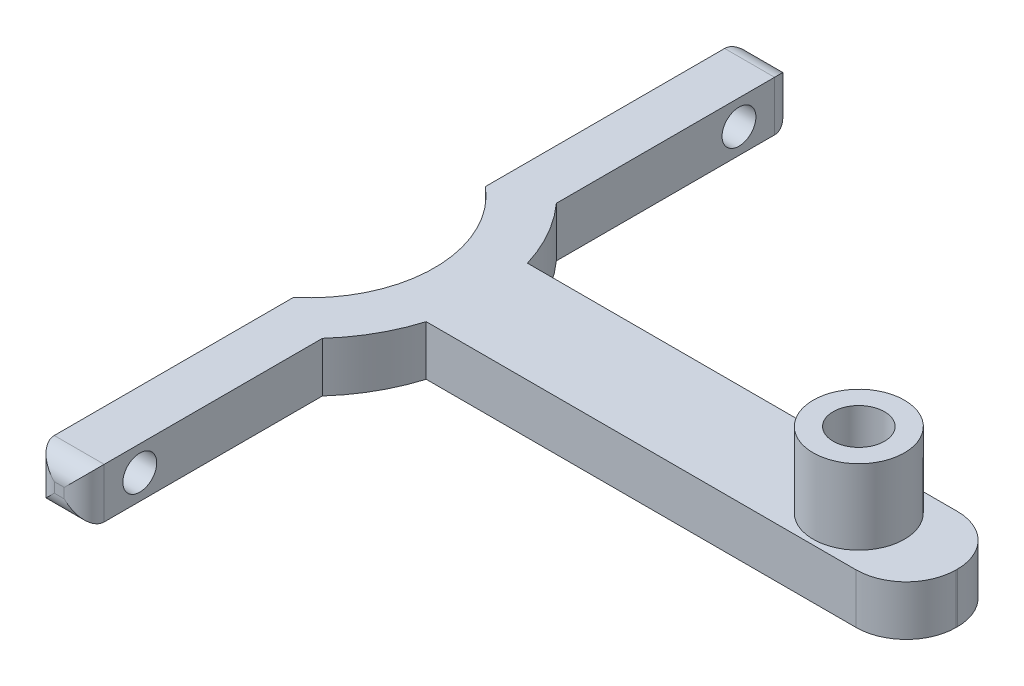
ISO-10303-21;
HEADER;
FILE_DESCRIPTION(('STEP AP214'),'2;1');
FILE_NAME('part.step','',(''),(''),'','','');
FILE_SCHEMA(('AUTOMOTIVE_DESIGN { 1 0 10303 214 1 1 1 1 }'));
ENDSEC;
DATA;
#1=APPLICATION_CONTEXT('core data for automotive mechanical design processes');
#2=APPLICATION_PROTOCOL_DEFINITION('international standard','automotive_design',2000,#1);
#3=PRODUCT_CONTEXT('',#1,'mechanical');
#4=PRODUCT('Part','Part','',(#3));
#5=PRODUCT_RELATED_PRODUCT_CATEGORY('part','',(#4));
#6=PRODUCT_DEFINITION_FORMATION('','',#4);
#7=PRODUCT_DEFINITION_CONTEXT('part definition',#1,'design');
#8=PRODUCT_DEFINITION('design','',#6,#7);
#9=PRODUCT_DEFINITION_SHAPE('','',#8);
#10=(LENGTH_UNIT() NAMED_UNIT(*) SI_UNIT(.MILLI.,.METRE.));
#11=(NAMED_UNIT(*) PLANE_ANGLE_UNIT() SI_UNIT($,.RADIAN.));
#12=(NAMED_UNIT(*) SI_UNIT($,.STERADIAN.) SOLID_ANGLE_UNIT());
#13=UNCERTAINTY_MEASURE_WITH_UNIT(LENGTH_MEASURE(1.E-05),#10,'distance_accuracy_value','');
#14=(GEOMETRIC_REPRESENTATION_CONTEXT(3) GLOBAL_UNCERTAINTY_ASSIGNED_CONTEXT((#13)) GLOBAL_UNIT_ASSIGNED_CONTEXT((#10,
#11,#12)) REPRESENTATION_CONTEXT('',''));
#15=CARTESIAN_POINT('',(0.,0.,0.));
#16=DIRECTION('',(0.,0.,1.));
#17=DIRECTION('',(1.,0.,0.));
#18=AXIS2_PLACEMENT_3D('',#15,#16,#17);
#19=CARTESIAN_POINT('',(10.16,0.,42.2389387108255));
#20=DIRECTION('',(1.,0.,0.));
#21=DIRECTION('',(0.,0.,-1.));
#22=AXIS2_PLACEMENT_3D('',#19,#20,#21);
#23=PLANE('',#22);
#24=DIRECTION('',(0.,0.,-1.));
#25=VECTOR('',#24,1.);
#26=CARTESIAN_POINT('',(10.16,3.175,42.2389387108255));
#27=LINE('',#26,#25);
#28=CARTESIAN_POINT('',(10.16,3.175,-12.1979516723096));
#29=VERTEX_POINT('',#28);
#30=CARTESIAN_POINT('',(10.16,3.175,-42.6267656686672));
#31=VERTEX_POINT('',#30);
#32=EDGE_CURVE('E232',#29,#31,#27,.T.);
#33=ORIENTED_EDGE('',*,*,#32,.T.);
#34=DIRECTION('',(0.,1.,0.));
#35=VECTOR('',#34,1.);
#36=CARTESIAN_POINT('',(10.16,-3.175,-42.6267656686672));
#37=LINE('',#36,#35);
#38=CARTESIAN_POINT('',(10.16,-3.175,-42.6267656686672));
#39=VERTEX_POINT('',#38);
#40=EDGE_CURVE('E47',#31,#39,#37,.F.);
#41=ORIENTED_EDGE('',*,*,#40,.T.);
#42=DIRECTION('',(0.,0.,-1.));
#43=VECTOR('',#42,1.);
#44=CARTESIAN_POINT('',(10.16,-3.175,0.));
#45=LINE('',#44,#43);
#46=CARTESIAN_POINT('',(10.16,-3.175,-12.1979516723096));
#47=VERTEX_POINT('',#46);
#48=EDGE_CURVE('E180',#47,#39,#45,.T.);
#49=ORIENTED_EDGE('',*,*,#48,.F.);
#50=DIRECTION('',(0.,-1.,0.));
#51=VECTOR('',#50,1.);
#52=CARTESIAN_POINT('',(10.16,3.175,-12.1979516723096));
#53=LINE('',#52,#51);
#54=EDGE_CURVE('E164',#47,#29,#53,.F.);
#55=ORIENTED_EDGE('',*,*,#54,.T.);
#56=EDGE_LOOP('',(#33,#41,#49,#55));
#57=FACE_BOUND('',#56,.T.);
#58=CARTESIAN_POINT('',(10.16,0.,-38.1));
#59=DIRECTION('',(1.,0.,0.));
#60=DIRECTION('',(0.,0.,-1.));
#61=AXIS2_PLACEMENT_3D('',#58,#59,#60);
#62=CIRCLE('',#61,2.15265);
#63=CARTESIAN_POINT('',(10.16,0.,-40.25265));
#64=VERTEX_POINT('',#63);
#65=EDGE_CURVE('E213',#64,#64,#62,.T.);
#66=ORIENTED_EDGE('',*,*,#65,.T.);
#67=EDGE_LOOP('',(#66));
#68=FACE_BOUND('',#67,.T.);
#69=ADVANCED_FACE('F38',(#57,#68),#23,.F.);
#70=CARTESIAN_POINT('',(10.16,-3.175,42.6267656686672));
#71=VERTEX_POINT('',#70);
#72=CARTESIAN_POINT('',(10.16,-3.175,12.1979516723096));
#73=VERTEX_POINT('',#72);
#74=EDGE_CURVE('E184',#71,#73,#45,.T.);
#75=ORIENTED_EDGE('',*,*,#74,.F.);
#76=DIRECTION('',(0.,1.,0.));
#77=VECTOR('',#76,1.);
#78=CARTESIAN_POINT('',(10.16,0.,42.6267656686672));
#79=LINE('',#78,#77);
#80=CARTESIAN_POINT('',(10.16,3.175,42.6267656686672));
#81=VERTEX_POINT('',#80);
#82=EDGE_CURVE('E286',#71,#81,#79,.T.);
#83=ORIENTED_EDGE('',*,*,#82,.T.);
#84=CARTESIAN_POINT('',(10.16,3.175,12.1979516723096));
#85=VERTEX_POINT('',#84);
#86=EDGE_CURVE('E234',#81,#85,#27,.T.);
#87=ORIENTED_EDGE('',*,*,#86,.T.);
#88=DIRECTION('',(0.,-1.,0.));
#89=VECTOR('',#88,1.);
#90=CARTESIAN_POINT('',(10.16,3.175,12.1979516723096));
#91=LINE('',#90,#89);
#92=EDGE_CURVE('E175',#85,#73,#91,.T.);
#93=ORIENTED_EDGE('',*,*,#92,.T.);
#94=EDGE_LOOP('',(#75,#83,#87,#93));
#95=FACE_BOUND('',#94,.T.);
#96=CARTESIAN_POINT('',(10.16,0.,38.1));
#97=DIRECTION('',(1.,0.,0.));
#98=DIRECTION('',(0.,0.,1.));
#99=AXIS2_PLACEMENT_3D('',#96,#97,#98);
#100=CIRCLE('',#99,2.15265);
#101=CARTESIAN_POINT('',(10.16,0.,40.25265));
#102=VERTEX_POINT('',#101);
#103=EDGE_CURVE('E210',#102,#102,#100,.T.);
#104=ORIENTED_EDGE('',*,*,#103,.T.);
#105=EDGE_LOOP('',(#104));
#106=FACE_BOUND('',#105,.T.);
#107=ADVANCED_FACE('F400',(#95,#106),#23,.F.);
#108=CARTESIAN_POINT('',(16.51,0.,-45.1667656686672));
#109=DIRECTION('',(1.,0.,0.));
#110=DIRECTION('',(0.,0.,-1.));
#111=AXIS2_PLACEMENT_3D('',#108,#109,#110);
#112=PLANE('',#111);
#113=DIRECTION('',(0.,0.,-1.));
#114=VECTOR('',#113,1.);
#115=CARTESIAN_POINT('',(16.51,-3.175,-45.1667656686672));
#116=LINE('',#115,#114);
#117=CARTESIAN_POINT('',(16.51,-3.175,-14.8785256326022));
#118=VERTEX_POINT('',#117);
#119=CARTESIAN_POINT('',(16.51,-3.175,-42.6267656686672));
#120=VERTEX_POINT('',#119);
#121=EDGE_CURVE('E331',#118,#120,#116,.T.);
#122=ORIENTED_EDGE('',*,*,#121,.T.);
#123=DIRECTION('',(0.,1.,0.));
#124=VECTOR('',#123,1.);
#125=CARTESIAN_POINT('',(16.51,0.,-42.6267656686672));
#126=LINE('',#125,#124);
#127=CARTESIAN_POINT('',(16.51,3.175,-42.6267656686672));
#128=VERTEX_POINT('',#127);
#129=EDGE_CURVE('E11',#120,#128,#126,.T.);
#130=ORIENTED_EDGE('',*,*,#129,.T.);
#131=DIRECTION('',(0.,0.,-1.));
#132=VECTOR('',#131,1.);
#133=CARTESIAN_POINT('',(16.51,3.175,-45.1667656686672));
#134=LINE('',#133,#132);
#135=CARTESIAN_POINT('',(16.51,3.175,-14.8785256326022));
#136=VERTEX_POINT('',#135);
#137=EDGE_CURVE('E227',#136,#128,#134,.T.);
#138=ORIENTED_EDGE('',*,*,#137,.F.);
#139=DIRECTION('',(0.,1.,0.));
#140=VECTOR('',#139,1.);
#141=CARTESIAN_POINT('',(16.51,0.,-14.8785256326022));
#142=LINE('',#141,#140);
#143=EDGE_CURVE('E230',#118,#136,#142,.T.);
#144=ORIENTED_EDGE('',*,*,#143,.F.);
#145=EDGE_LOOP('',(#122,#130,#138,#144));
#146=FACE_BOUND('',#145,.T.);
#147=CARTESIAN_POINT('',(16.51,0.,-38.1));
#148=DIRECTION('',(1.,0.,0.));
#149=DIRECTION('',(0.,0.,-1.));
#150=AXIS2_PLACEMENT_3D('',#147,#148,#149);
#151=CIRCLE('',#150,2.15265);
#152=CARTESIAN_POINT('',(16.51,0.,-40.25265));
#153=VERTEX_POINT('',#152);
#154=EDGE_CURVE('E217',#153,#153,#151,.T.);
#155=ORIENTED_EDGE('',*,*,#154,.F.);
#156=EDGE_LOOP('',(#155));
#157=FACE_BOUND('',#156,.T.);
#158=ADVANCED_FACE('F328',(#146,#157),#112,.T.);
#159=CARTESIAN_POINT('',(16.51,0.,45.1667656686672));
#160=DIRECTION('',(-1.,0.,0.));
#161=DIRECTION('',(0.,0.,1.));
#162=AXIS2_PLACEMENT_3D('',#159,#160,#161);
#163=PLANE('',#162);
#164=DIRECTION('',(0.,0.,1.));
#165=VECTOR('',#164,1.);
#166=CARTESIAN_POINT('',(16.51,3.175,45.1667656686672));
#167=LINE('',#166,#165);
#168=CARTESIAN_POINT('',(16.51,3.175,14.8785256326022));
#169=VERTEX_POINT('',#168);
#170=CARTESIAN_POINT('',(16.51,3.175,42.6267656686672));
#171=VERTEX_POINT('',#170);
#172=EDGE_CURVE('E216',#169,#171,#167,.T.);
#173=ORIENTED_EDGE('',*,*,#172,.T.);
#174=DIRECTION('',(0.,1.,0.));
#175=VECTOR('',#174,1.);
#176=CARTESIAN_POINT('',(16.51,0.,42.6267656686672));
#177=LINE('',#176,#175);
#178=CARTESIAN_POINT('',(16.51,-3.175,42.6267656686672));
#179=VERTEX_POINT('',#178);
#180=EDGE_CURVE('E279',#171,#179,#177,.F.);
#181=ORIENTED_EDGE('',*,*,#180,.T.);
#182=DIRECTION('',(0.,0.,1.));
#183=VECTOR('',#182,1.);
#184=CARTESIAN_POINT('',(16.51,-3.175,45.1667656686672));
#185=LINE('',#184,#183);
#186=CARTESIAN_POINT('',(16.51,-3.175,14.8785256326022));
#187=VERTEX_POINT('',#186);
#188=EDGE_CURVE('E309',#187,#179,#185,.T.);
#189=ORIENTED_EDGE('',*,*,#188,.F.);
#190=DIRECTION('',(0.,1.,0.));
#191=VECTOR('',#190,1.);
#192=CARTESIAN_POINT('',(16.51,0.,14.8785256326022));
#193=LINE('',#192,#191);
#194=EDGE_CURVE('E224',#187,#169,#193,.T.);
#195=ORIENTED_EDGE('',*,*,#194,.T.);
#196=EDGE_LOOP('',(#173,#181,#189,#195));
#197=FACE_BOUND('',#196,.T.);
#198=CARTESIAN_POINT('',(16.51,0.,38.1));
#199=DIRECTION('',(-1.,0.,0.));
#200=DIRECTION('',(0.,0.,1.));
#201=AXIS2_PLACEMENT_3D('',#198,#199,#200);
#202=CIRCLE('',#201,2.15265);
#203=CARTESIAN_POINT('',(16.51,0.,40.25265));
#204=VERTEX_POINT('',#203);
#205=EDGE_CURVE('E185',#204,#204,#202,.T.);
#206=ORIENTED_EDGE('',*,*,#205,.T.);
#207=EDGE_LOOP('',(#206));
#208=FACE_BOUND('',#207,.T.);
#209=ADVANCED_FACE('F377',(#197,#208),#163,.F.);
#210=CARTESIAN_POINT('',(0.,3.175,0.));
#211=DIRECTION('',(0.,-1.,0.));
#212=DIRECTION('',(0.,0.,-1.));
#213=AXIS2_PLACEMENT_3D('',#210,#211,#212);
#214=CYLINDRICAL_SURFACE('',#213,22.225);
#215=CARTESIAN_POINT('',(0.,-3.175,0.));
#216=DIRECTION('',(0.,1.,0.));
#217=DIRECTION('',(0.,0.,1.));
#218=AXIS2_PLACEMENT_3D('',#215,#216,#217);
#219=CIRCLE('',#218,22.225);
#220=CARTESIAN_POINT('',(21.2718403479812,-3.175,-6.43890000000001));
#221=VERTEX_POINT('',#220);
#222=EDGE_CURVE('E195',#221,#118,#219,.T.);
#223=ORIENTED_EDGE('',*,*,#222,.T.);
#224=ORIENTED_EDGE('',*,*,#143,.T.);
#225=CARTESIAN_POINT('',(0.,3.175,0.));
#226=DIRECTION('',(0.,1.,0.));
#227=DIRECTION('',(0.,0.,1.));
#228=AXIS2_PLACEMENT_3D('',#225,#226,#227);
#229=CIRCLE('',#228,22.225);
#230=CARTESIAN_POINT('',(21.2718403479812,3.175,-6.43890000000001));
#231=VERTEX_POINT('',#230);
#232=EDGE_CURVE('E260',#231,#136,#229,.T.);
#233=ORIENTED_EDGE('',*,*,#232,.F.);
#234=DIRECTION('',(0.,-1.,0.));
#235=VECTOR('',#234,1.);
#236=CARTESIAN_POINT('',(21.2718403479812,3.175,-6.43890000000001));
#237=LINE('',#236,#235);
#238=EDGE_CURVE('E176',#231,#221,#237,.T.);
#239=ORIENTED_EDGE('',*,*,#238,.T.);
#240=EDGE_LOOP('',(#223,#224,#233,#239));
#241=FACE_BOUND('',#240,.T.);
#242=ADVANCED_FACE('F339',(#241),#214,.T.);
#243=ORIENTED_EDGE('',*,*,#194,.F.);
#244=CARTESIAN_POINT('',(21.2718403479812,-3.175,6.43890000000001));
#245=VERTEX_POINT('',#244);
#246=EDGE_CURVE('E192',#187,#245,#219,.T.);
#247=ORIENTED_EDGE('',*,*,#246,.T.);
#248=DIRECTION('',(0.,-1.,0.));
#249=VECTOR('',#248,1.);
#250=CARTESIAN_POINT('',(21.2718403479812,3.175,6.43890000000001));
#251=LINE('',#250,#249);
#252=CARTESIAN_POINT('',(21.2718403479812,3.175,6.43890000000001));
#253=VERTEX_POINT('',#252);
#254=EDGE_CURVE('E263',#245,#253,#251,.F.);
#255=ORIENTED_EDGE('',*,*,#254,.T.);
#256=EDGE_CURVE('E259',#169,#253,#229,.T.);
#257=ORIENTED_EDGE('',*,*,#256,.F.);
#258=EDGE_LOOP('',(#243,#247,#255,#257));
#259=FACE_BOUND('',#258,.T.);
#260=ADVANCED_FACE('F445',(#259),#214,.T.);
#261=CARTESIAN_POINT('',(0.,3.175,0.));
#262=DIRECTION('',(0.,-1.,0.));
#263=DIRECTION('',(0.,0.,-1.));
#264=AXIS2_PLACEMENT_3D('',#261,#262,#263);
#265=CYLINDRICAL_SURFACE('',#264,15.875);
#266=ORIENTED_EDGE('',*,*,#54,.F.);
#267=CARTESIAN_POINT('',(0.,-3.175,0.));
#268=DIRECTION('',(0.,1.,0.));
#269=DIRECTION('',(0.,0.,1.));
#270=AXIS2_PLACEMENT_3D('',#267,#268,#269);
#271=CIRCLE('',#270,15.875);
#272=EDGE_CURVE('E169',#73,#47,#271,.T.);
#273=ORIENTED_EDGE('',*,*,#272,.F.);
#274=ORIENTED_EDGE('',*,*,#92,.F.);
#275=CARTESIAN_POINT('',(0.,3.175,0.));
#276=DIRECTION('',(0.,1.,0.));
#277=DIRECTION('',(0.,0.,1.));
#278=AXIS2_PLACEMENT_3D('',#275,#276,#277);
#279=CIRCLE('',#278,15.875);
#280=EDGE_CURVE('E171',#85,#29,#279,.T.);
#281=ORIENTED_EDGE('',*,*,#280,.T.);
#282=EDGE_LOOP('',(#266,#273,#274,#281));
#283=FACE_BOUND('',#282,.T.);
#284=ADVANCED_FACE('F166',(#283),#265,.F.);
#285=CARTESIAN_POINT('',(0.,-3.175,0.));
#286=DIRECTION('',(0.,-1.,0.));
#287=DIRECTION('',(0.,0.,1.));
#288=AXIS2_PLACEMENT_3D('',#285,#286,#287);
#289=PLANE('',#288);
#290=ORIENTED_EDGE('',*,*,#188,.T.);
#291=DIRECTION('',(-1.,0.,0.));
#292=VECTOR('',#291,1.);
#293=CARTESIAN_POINT('',(10.16,-3.175,42.6267656686672));
#294=LINE('',#293,#292);
#295=EDGE_CURVE('E284',#179,#71,#294,.T.);
#296=ORIENTED_EDGE('',*,*,#295,.T.);
#297=ORIENTED_EDGE('',*,*,#74,.T.);
#298=ORIENTED_EDGE('',*,*,#272,.T.);
#299=ORIENTED_EDGE('',*,*,#48,.T.);
#300=DIRECTION('',(-1.,0.,0.));
#301=VECTOR('',#300,1.);
#302=CARTESIAN_POINT('',(0.,-3.175,-42.6267656686672));
#303=LINE('',#302,#301);
#304=EDGE_CURVE('E282',#39,#120,#303,.F.);
#305=ORIENTED_EDGE('',*,*,#304,.T.);
#306=ORIENTED_EDGE('',*,*,#121,.F.);
#307=ORIENTED_EDGE('',*,*,#222,.F.);
#308=DIRECTION('',(-1.,0.,0.));
#309=VECTOR('',#308,1.);
#310=CARTESIAN_POINT('',(75.953359527305,-3.175,-6.4389));
#311=LINE('',#310,#309);
#312=CARTESIAN_POINT('',(75.953359527305,-3.175,-6.4389));
#313=VERTEX_POINT('',#312);
#314=EDGE_CURVE('E346',#313,#221,#311,.T.);
#315=ORIENTED_EDGE('',*,*,#314,.F.);
#316=CARTESIAN_POINT('',(75.953359527305,-3.175,-0.0889000000000011));
#317=DIRECTION('',(0.,1.,0.));
#318=DIRECTION('',(0.,0.,1.));
#319=AXIS2_PLACEMENT_3D('',#316,#317,#318);
#320=CIRCLE('',#319,6.35);
#321=CARTESIAN_POINT('',(82.303359527305,-3.175,-0.0888999999999993));
#322=VERTEX_POINT('',#321);
#323=EDGE_CURVE('E351',#322,#313,#320,.T.);
#324=ORIENTED_EDGE('',*,*,#323,.F.);
#325=DIRECTION('',(0.,0.,-1.));
#326=VECTOR('',#325,1.);
#327=CARTESIAN_POINT('',(82.303359527305,-3.175,0.0889));
#328=LINE('',#327,#326);
#329=CARTESIAN_POINT('',(82.303359527305,-3.175,0.0889));
#330=VERTEX_POINT('',#329);
#331=EDGE_CURVE('E354',#330,#322,#328,.T.);
#332=ORIENTED_EDGE('',*,*,#331,.F.);
#333=CARTESIAN_POINT('',(75.953359527305,-3.175,0.0889000000000011));
#334=DIRECTION('',(0.,1.,0.));
#335=DIRECTION('',(0.,0.,-1.));
#336=AXIS2_PLACEMENT_3D('',#333,#334,#335);
#337=CIRCLE('',#336,6.35);
#338=CARTESIAN_POINT('',(75.953359527305,-3.175,6.4389));
#339=VERTEX_POINT('',#338);
#340=EDGE_CURVE('E198',#339,#330,#337,.T.);
#341=ORIENTED_EDGE('',*,*,#340,.F.);
#342=DIRECTION('',(1.,0.,0.));
#343=VECTOR('',#342,1.);
#344=CARTESIAN_POINT('',(38.5188395273051,-3.175,6.43890000000001));
#345=LINE('',#344,#343);
#346=EDGE_CURVE('E193',#245,#339,#345,.T.);
#347=ORIENTED_EDGE('',*,*,#346,.F.);
#348=ORIENTED_EDGE('',*,*,#246,.F.);
#349=EDGE_LOOP('',(#290,#296,#297,#298,#299,#305,#306,#307,#315,#324,#332,#341,#347,#348));
#350=FACE_BOUND('',#349,.T.);
#351=CARTESIAN_POINT('',(69.85,-3.175,0.));
#352=DIRECTION('',(0.,-1.,0.));
#353=DIRECTION('',(0.,0.,-1.));
#354=AXIS2_PLACEMENT_3D('',#351,#352,#353);
#355=CIRCLE('',#354,3.2639);
#356=CARTESIAN_POINT('',(69.85,-3.175,-3.2639));
#357=VERTEX_POINT('',#356);
#358=EDGE_CURVE('E343',#357,#357,#355,.T.);
#359=ORIENTED_EDGE('',*,*,#358,.F.);
#360=EDGE_LOOP('',(#359));
#361=FACE_BOUND('',#360,.T.);
#362=ADVANCED_FACE('F188',(#350,#361),#289,.T.);
#363=CARTESIAN_POINT('',(0.,3.175,0.));
#364=DIRECTION('',(0.,1.,0.));
#365=DIRECTION('',(0.,0.,1.));
#366=AXIS2_PLACEMENT_3D('',#363,#364,#365);
#367=PLANE('',#366);
#368=ORIENTED_EDGE('',*,*,#86,.F.);
#369=DIRECTION('',(-1.,0.,0.));
#370=VECTOR('',#369,1.);
#371=CARTESIAN_POINT('',(16.51,3.175,42.6267656686672));
#372=LINE('',#371,#370);
#373=EDGE_CURVE('E290',#81,#171,#372,.F.);
#374=ORIENTED_EDGE('',*,*,#373,.T.);
#375=ORIENTED_EDGE('',*,*,#172,.F.);
#376=ORIENTED_EDGE('',*,*,#256,.T.);
#377=DIRECTION('',(1.,0.,0.));
#378=VECTOR('',#377,1.);
#379=CARTESIAN_POINT('',(75.953359527305,3.175,6.4389));
#380=LINE('',#379,#378);
#381=CARTESIAN_POINT('',(75.953359527305,3.175,6.4389));
#382=VERTEX_POINT('',#381);
#383=EDGE_CURVE('E235',#253,#382,#380,.T.);
#384=ORIENTED_EDGE('',*,*,#383,.T.);
#385=CARTESIAN_POINT('',(75.953359527305,3.175,0.0889000000000011));
#386=DIRECTION('',(0.,1.,0.));
#387=DIRECTION('',(0.,0.,-1.));
#388=AXIS2_PLACEMENT_3D('',#385,#386,#387);
#389=CIRCLE('',#388,6.35);
#390=CARTESIAN_POINT('',(82.303359527305,3.175,0.0889));
#391=VERTEX_POINT('',#390);
#392=EDGE_CURVE('E237',#382,#391,#389,.T.);
#393=ORIENTED_EDGE('',*,*,#392,.T.);
#394=DIRECTION('',(0.,0.,-1.));
#395=VECTOR('',#394,1.);
#396=CARTESIAN_POINT('',(82.303359527305,3.175,0.0889));
#397=LINE('',#396,#395);
#398=CARTESIAN_POINT('',(82.303359527305,3.175,-0.0888999999999993));
#399=VERTEX_POINT('',#398);
#400=EDGE_CURVE('E240',#391,#399,#397,.T.);
#401=ORIENTED_EDGE('',*,*,#400,.T.);
#402=CARTESIAN_POINT('',(75.953359527305,3.175,-0.0889000000000011));
#403=DIRECTION('',(0.,1.,0.));
#404=DIRECTION('',(0.,0.,1.));
#405=AXIS2_PLACEMENT_3D('',#402,#403,#404);
#406=CIRCLE('',#405,6.35);
#407=CARTESIAN_POINT('',(75.953359527305,3.175,-6.4389));
#408=VERTEX_POINT('',#407);
#409=EDGE_CURVE('E243',#399,#408,#406,.T.);
#410=ORIENTED_EDGE('',*,*,#409,.T.);
#411=DIRECTION('',(-1.,0.,0.));
#412=VECTOR('',#411,1.);
#413=CARTESIAN_POINT('',(38.5188395273051,3.175,-6.43890000000001));
#414=LINE('',#413,#412);
#415=EDGE_CURVE('E246',#408,#231,#414,.T.);
#416=ORIENTED_EDGE('',*,*,#415,.T.);
#417=ORIENTED_EDGE('',*,*,#232,.T.);
#418=ORIENTED_EDGE('',*,*,#137,.T.);
#419=DIRECTION('',(-1.,0.,0.));
#420=VECTOR('',#419,1.);
#421=CARTESIAN_POINT('',(0.,3.175,-42.6267656686672));
#422=LINE('',#421,#420);
#423=EDGE_CURVE('E288',#128,#31,#422,.T.);
#424=ORIENTED_EDGE('',*,*,#423,.T.);
#425=ORIENTED_EDGE('',*,*,#32,.F.);
#426=ORIENTED_EDGE('',*,*,#280,.F.);
#427=EDGE_LOOP('',(#368,#374,#375,#376,#384,#393,#401,#410,#416,#417,#418,#424,#425,#426));
#428=FACE_BOUND('',#427,.T.);
#429=CARTESIAN_POINT('',(69.85,3.175,0.));
#430=DIRECTION('',(0.,1.,0.));
#431=DIRECTION('',(0.,0.,1.));
#432=AXIS2_PLACEMENT_3D('',#429,#430,#431);
#433=CIRCLE('',#432,5.8039);
#434=CARTESIAN_POINT('',(69.85,3.175,-5.8039));
#435=VERTEX_POINT('',#434);
#436=EDGE_CURVE('E206',#435,#435,#433,.T.);
#437=ORIENTED_EDGE('',*,*,#436,.F.);
#438=EDGE_LOOP('',(#437));
#439=FACE_BOUND('',#438,.T.);
#440=ADVANCED_FACE('F334',(#428,#439),#367,.T.);
#441=CARTESIAN_POINT('',(38.5188395273051,0.,-6.43890000000001));
#442=DIRECTION('',(0.,0.,-1.));
#443=DIRECTION('',(-1.,0.,0.));
#444=AXIS2_PLACEMENT_3D('',#441,#442,#443);
#445=PLANE('',#444);
#446=ORIENTED_EDGE('',*,*,#238,.F.);
#447=ORIENTED_EDGE('',*,*,#415,.F.);
#448=DIRECTION('',(0.,1.,0.));
#449=VECTOR('',#448,1.);
#450=CARTESIAN_POINT('',(75.953359527305,0.,-6.4389));
#451=LINE('',#450,#449);
#452=EDGE_CURVE('E249',#313,#408,#451,.T.);
#453=ORIENTED_EDGE('',*,*,#452,.F.);
#454=ORIENTED_EDGE('',*,*,#314,.T.);
#455=EDGE_LOOP('',(#446,#447,#453,#454));
#456=FACE_BOUND('',#455,.T.);
#457=ADVANCED_FACE('F429',(#456),#445,.T.);
#458=CARTESIAN_POINT('',(75.953359527305,0.,6.4389));
#459=DIRECTION('',(0.,0.,1.));
#460=DIRECTION('',(1.,0.,0.));
#461=AXIS2_PLACEMENT_3D('',#458,#459,#460);
#462=PLANE('',#461);
#463=ORIENTED_EDGE('',*,*,#254,.F.);
#464=ORIENTED_EDGE('',*,*,#346,.T.);
#465=DIRECTION('',(0.,1.,0.));
#466=VECTOR('',#465,1.);
#467=CARTESIAN_POINT('',(75.953359527305,0.,6.4389));
#468=LINE('',#467,#466);
#469=EDGE_CURVE('E248',#339,#382,#468,.T.);
#470=ORIENTED_EDGE('',*,*,#469,.T.);
#471=ORIENTED_EDGE('',*,*,#383,.F.);
#472=EDGE_LOOP('',(#463,#464,#470,#471));
#473=FACE_BOUND('',#472,.T.);
#474=ADVANCED_FACE('F372',(#473),#462,.T.);
#475=CARTESIAN_POINT('',(75.953359527305,0.,-0.0889000000000011));
#476=DIRECTION('',(0.,1.,0.));
#477=DIRECTION('',(0.,0.,1.));
#478=AXIS2_PLACEMENT_3D('',#475,#476,#477);
#479=CYLINDRICAL_SURFACE('',#478,6.35);
#480=ORIENTED_EDGE('',*,*,#409,.F.);
#481=DIRECTION('',(0.,1.,0.));
#482=VECTOR('',#481,1.);
#483=CARTESIAN_POINT('',(82.303359527305,0.,-0.0888999999999993));
#484=LINE('',#483,#482);
#485=EDGE_CURVE('E252',#322,#399,#484,.T.);
#486=ORIENTED_EDGE('',*,*,#485,.F.);
#487=ORIENTED_EDGE('',*,*,#323,.T.);
#488=ORIENTED_EDGE('',*,*,#452,.T.);
#489=EDGE_LOOP('',(#480,#486,#487,#488));
#490=FACE_BOUND('',#489,.T.);
#491=ADVANCED_FACE('F433',(#490),#479,.T.);
#492=CARTESIAN_POINT('',(82.303359527305,0.,0.0889));
#493=DIRECTION('',(1.,0.,0.));
#494=DIRECTION('',(0.,0.,-1.));
#495=AXIS2_PLACEMENT_3D('',#492,#493,#494);
#496=PLANE('',#495);
#497=ORIENTED_EDGE('',*,*,#400,.F.);
#498=DIRECTION('',(0.,1.,0.));
#499=VECTOR('',#498,1.);
#500=CARTESIAN_POINT('',(82.303359527305,0.,0.0889));
#501=LINE('',#500,#499);
#502=EDGE_CURVE('E254',#330,#391,#501,.T.);
#503=ORIENTED_EDGE('',*,*,#502,.F.);
#504=ORIENTED_EDGE('',*,*,#331,.T.);
#505=ORIENTED_EDGE('',*,*,#485,.T.);
#506=EDGE_LOOP('',(#497,#503,#504,#505));
#507=FACE_BOUND('',#506,.T.);
#508=ADVANCED_FACE('F366',(#507),#496,.T.);
#509=CARTESIAN_POINT('',(75.953359527305,0.,0.0889000000000011));
#510=DIRECTION('',(0.,1.,0.));
#511=DIRECTION('',(0.,0.,1.));
#512=AXIS2_PLACEMENT_3D('',#509,#510,#511);
#513=CYLINDRICAL_SURFACE('',#512,6.35);
#514=ORIENTED_EDGE('',*,*,#392,.F.);
#515=ORIENTED_EDGE('',*,*,#469,.F.);
#516=ORIENTED_EDGE('',*,*,#340,.T.);
#517=ORIENTED_EDGE('',*,*,#502,.T.);
#518=EDGE_LOOP('',(#514,#515,#516,#517));
#519=FACE_BOUND('',#518,.T.);
#520=ADVANCED_FACE('F361',(#519),#513,.T.);
#521=CARTESIAN_POINT('',(69.85,3.175,0.));
#522=DIRECTION('',(0.,1.,0.));
#523=DIRECTION('',(0.,0.,1.));
#524=AXIS2_PLACEMENT_3D('',#521,#522,#523);
#525=CYLINDRICAL_SURFACE('',#524,3.2639);
#526=CARTESIAN_POINT('',(69.85,12.7,0.));
#527=DIRECTION('',(0.,1.,0.));
#528=DIRECTION('',(0.,0.,1.));
#529=AXIS2_PLACEMENT_3D('',#526,#527,#528);
#530=CIRCLE('',#529,3.26390000000001);
#531=CARTESIAN_POINT('',(69.85,12.7,3.26390000000001));
#532=VERTEX_POINT('',#531);
#533=EDGE_CURVE('E203',#532,#532,#530,.T.);
#534=ORIENTED_EDGE('',*,*,#533,.T.);
#535=EDGE_LOOP('',(#534));
#536=FACE_BOUND('',#535,.T.);
#537=ORIENTED_EDGE('',*,*,#358,.T.);
#538=EDGE_LOOP('',(#537));
#539=FACE_BOUND('',#538,.T.);
#540=ADVANCED_FACE('F424',(#536,#539),#525,.F.);
#541=CARTESIAN_POINT('',(10.16,0.,-45.1667656686672));
#542=DIRECTION('',(0.,0.,-1.));
#543=DIRECTION('',(-1.,0.,0.));
#544=AXIS2_PLACEMENT_3D('',#541,#542,#543);
#545=PLANE('',#544);
#546=DIRECTION('',(-1.,0.,0.));
#547=VECTOR('',#546,1.);
#548=CARTESIAN_POINT('',(10.16,-0.635,-45.1667656686672));
#549=LINE('',#548,#547);
#550=CARTESIAN_POINT('',(13.97,-0.635,-45.1667656686672));
#551=VERTEX_POINT('',#550);
#552=CARTESIAN_POINT('',(12.7,-0.635,-45.1667656686672));
#553=VERTEX_POINT('',#552);
#554=EDGE_CURVE('E55',#551,#553,#549,.T.);
#555=ORIENTED_EDGE('',*,*,#554,.T.);
#556=DIRECTION('',(0.,1.,0.));
#557=VECTOR('',#556,1.);
#558=CARTESIAN_POINT('',(12.7,3.175,-45.1667656686672));
#559=LINE('',#558,#557);
#560=CARTESIAN_POINT('',(12.7,0.635,-45.1667656686672));
#561=VERTEX_POINT('',#560);
#562=EDGE_CURVE('E296',#553,#561,#559,.T.);
#563=ORIENTED_EDGE('',*,*,#562,.T.);
#564=DIRECTION('',(-1.,0.,0.));
#565=VECTOR('',#564,1.);
#566=CARTESIAN_POINT('',(10.16,0.635,-45.1667656686672));
#567=LINE('',#566,#565);
#568=CARTESIAN_POINT('',(13.97,0.635,-45.1667656686672));
#569=VERTEX_POINT('',#568);
#570=EDGE_CURVE('E292',#561,#569,#567,.F.);
#571=ORIENTED_EDGE('',*,*,#570,.T.);
#572=DIRECTION('',(0.,1.,0.));
#573=VECTOR('',#572,1.);
#574=CARTESIAN_POINT('',(13.97,0.,-45.1667656686672));
#575=LINE('',#574,#573);
#576=EDGE_CURVE('E60',#569,#551,#575,.F.);
#577=ORIENTED_EDGE('',*,*,#576,.T.);
#578=EDGE_LOOP('',(#555,#563,#571,#577));
#579=FACE_BOUND('',#578,.T.);
#580=ADVANCED_FACE('F427',(#579),#545,.T.);
#581=CARTESIAN_POINT('',(10.16,0.,45.1667656686672));
#582=DIRECTION('',(0.,0.,-1.));
#583=DIRECTION('',(-1.,0.,0.));
#584=AXIS2_PLACEMENT_3D('',#581,#582,#583);
#585=PLANE('',#584);
#586=DIRECTION('',(-1.,0.,0.));
#587=VECTOR('',#586,1.);
#588=CARTESIAN_POINT('',(16.51,-0.635,45.1667656686672));
#589=LINE('',#588,#587);
#590=CARTESIAN_POINT('',(12.7,-0.635,45.1667656686672));
#591=VERTEX_POINT('',#590);
#592=CARTESIAN_POINT('',(13.97,-0.635,45.1667656686672));
#593=VERTEX_POINT('',#592);
#594=EDGE_CURVE('E274',#591,#593,#589,.F.);
#595=ORIENTED_EDGE('',*,*,#594,.T.);
#596=DIRECTION('',(0.,1.,0.));
#597=VECTOR('',#596,1.);
#598=CARTESIAN_POINT('',(13.97,0.,45.1667656686672));
#599=LINE('',#598,#597);
#600=CARTESIAN_POINT('',(13.97,0.635,45.1667656686672));
#601=VERTEX_POINT('',#600);
#602=EDGE_CURVE('E276',#593,#601,#599,.T.);
#603=ORIENTED_EDGE('',*,*,#602,.T.);
#604=DIRECTION('',(-1.,0.,0.));
#605=VECTOR('',#604,1.);
#606=CARTESIAN_POINT('',(10.16,0.635,45.1667656686672));
#607=LINE('',#606,#605);
#608=CARTESIAN_POINT('',(12.7,0.635,45.1667656686672));
#609=VERTEX_POINT('',#608);
#610=EDGE_CURVE('E270',#601,#609,#607,.T.);
#611=ORIENTED_EDGE('',*,*,#610,.T.);
#612=DIRECTION('',(0.,1.,0.));
#613=VECTOR('',#612,1.);
#614=CARTESIAN_POINT('',(12.7,0.,45.1667656686672));
#615=LINE('',#614,#613);
#616=EDGE_CURVE('E272',#609,#591,#615,.F.);
#617=ORIENTED_EDGE('',*,*,#616,.T.);
#618=EDGE_LOOP('',(#595,#603,#611,#617));
#619=FACE_BOUND('',#618,.T.);
#620=ADVANCED_FACE('F393',(#619),#585,.F.);
#621=CARTESIAN_POINT('',(10.16,0.,38.1));
#622=DIRECTION('',(1.,0.,0.));
#623=DIRECTION('',(0.,0.,-1.));
#624=AXIS2_PLACEMENT_3D('',#621,#622,#623);
#625=CYLINDRICAL_SURFACE('',#624,2.15265);
#626=ORIENTED_EDGE('',*,*,#205,.F.);
#627=EDGE_LOOP('',(#626));
#628=FACE_BOUND('',#627,.T.);
#629=ORIENTED_EDGE('',*,*,#103,.F.);
#630=EDGE_LOOP('',(#629));
#631=FACE_BOUND('',#630,.T.);
#632=ADVANCED_FACE('F516',(#628,#631),#625,.F.);
#633=CARTESIAN_POINT('',(10.16,0.,-38.1));
#634=DIRECTION('',(1.,0.,0.));
#635=DIRECTION('',(0.,0.,-1.));
#636=AXIS2_PLACEMENT_3D('',#633,#634,#635);
#637=CYLINDRICAL_SURFACE('',#636,2.15265);
#638=ORIENTED_EDGE('',*,*,#154,.T.);
#639=EDGE_LOOP('',(#638));
#640=FACE_BOUND('',#639,.T.);
#641=ORIENTED_EDGE('',*,*,#65,.F.);
#642=EDGE_LOOP('',(#641));
#643=FACE_BOUND('',#642,.T.);
#644=ADVANCED_FACE('F509',(#640,#643),#637,.F.);
#645=CARTESIAN_POINT('',(69.85,12.7,0.));
#646=DIRECTION('',(0.,1.,0.));
#647=DIRECTION('',(0.,0.,1.));
#648=AXIS2_PLACEMENT_3D('',#645,#646,#647);
#649=PLANE('',#648);
#650=CARTESIAN_POINT('',(69.85,12.7,0.));
#651=DIRECTION('',(0.,1.,0.));
#652=DIRECTION('',(0.,0.,1.));
#653=AXIS2_PLACEMENT_3D('',#650,#651,#652);
#654=CIRCLE('',#653,5.8039);
#655=CARTESIAN_POINT('',(69.85,12.7,-5.8039));
#656=VERTEX_POINT('',#655);
#657=EDGE_CURVE('E207',#656,#656,#654,.T.);
#658=ORIENTED_EDGE('',*,*,#657,.T.);
#659=EDGE_LOOP('',(#658));
#660=FACE_BOUND('',#659,.T.);
#661=ORIENTED_EDGE('',*,*,#533,.F.);
#662=EDGE_LOOP('',(#661));
#663=FACE_BOUND('',#662,.T.);
#664=ADVANCED_FACE('F412',(#660,#663),#649,.T.);
#665=CARTESIAN_POINT('',(69.85,12.7,0.));
#666=DIRECTION('',(0.,-1.,0.));
#667=DIRECTION('',(0.,0.,-1.));
#668=AXIS2_PLACEMENT_3D('',#665,#666,#667);
#669=CYLINDRICAL_SURFACE('',#668,5.8039);
#670=CARTESIAN_POINT('',(69.85,12.7,-5.8039));
#671=CARTESIAN_POINT('',(69.85,12.60078125,-5.8039));
#672=CARTESIAN_POINT('',(69.85,12.5015625,-5.8039));
#673=CARTESIAN_POINT('',(69.85,12.303125,-5.8039));
#674=CARTESIAN_POINT('',(69.85,12.20390625,-5.8039));
#675=CARTESIAN_POINT('',(69.85,12.00546875,-5.8039));
#676=CARTESIAN_POINT('',(69.85,11.90625,-5.8039));
#677=CARTESIAN_POINT('',(69.85,11.7078125,-5.8039));
#678=CARTESIAN_POINT('',(69.85,11.60859375,-5.8039));
#679=CARTESIAN_POINT('',(69.85,11.41015625,-5.8039));
#680=CARTESIAN_POINT('',(69.85,11.3109375,-5.8039));
#681=CARTESIAN_POINT('',(69.85,11.1125,-5.8039));
#682=CARTESIAN_POINT('',(69.85,11.01328125,-5.8039));
#683=CARTESIAN_POINT('',(69.85,10.81484375,-5.8039));
#684=CARTESIAN_POINT('',(69.85,10.715625,-5.8039));
#685=CARTESIAN_POINT('',(69.85,10.5171875,-5.8039));
#686=CARTESIAN_POINT('',(69.85,10.41796875,-5.8039));
#687=CARTESIAN_POINT('',(69.85,10.21953125,-5.8039));
#688=CARTESIAN_POINT('',(69.85,10.1203125,-5.8039));
#689=CARTESIAN_POINT('',(69.85,9.921875,-5.8039));
#690=CARTESIAN_POINT('',(69.85,9.82265625,-5.8039));
#691=CARTESIAN_POINT('',(69.85,9.62421875,-5.8039));
#692=CARTESIAN_POINT('',(69.85,9.525,-5.8039));
#693=CARTESIAN_POINT('',(69.85,9.3265625,-5.8039));
#694=CARTESIAN_POINT('',(69.85,9.22734375,-5.8039));
#695=CARTESIAN_POINT('',(69.85,9.02890625,-5.8039));
#696=CARTESIAN_POINT('',(69.85,8.9296875,-5.8039));
#697=CARTESIAN_POINT('',(69.85,8.73125,-5.8039));
#698=CARTESIAN_POINT('',(69.85,8.63203125,-5.8039));
#699=CARTESIAN_POINT('',(69.85,8.43359375,-5.8039));
#700=CARTESIAN_POINT('',(69.85,8.334375,-5.8039));
#701=CARTESIAN_POINT('',(69.85,8.1359375,-5.8039));
#702=CARTESIAN_POINT('',(69.85,8.03671875,-5.8039));
#703=CARTESIAN_POINT('',(69.85,7.83828125,-5.8039));
#704=CARTESIAN_POINT('',(69.85,7.7390625,-5.8039));
#705=CARTESIAN_POINT('',(69.85,7.540625,-5.8039));
#706=CARTESIAN_POINT('',(69.85,7.44140625,-5.8039));
#707=CARTESIAN_POINT('',(69.85,7.24296875,-5.8039));
#708=CARTESIAN_POINT('',(69.85,7.14375,-5.8039));
#709=CARTESIAN_POINT('',(69.85,6.9453125,-5.8039));
#710=CARTESIAN_POINT('',(69.85,6.84609375,-5.8039));
#711=CARTESIAN_POINT('',(69.85,6.64765625,-5.8039));
#712=CARTESIAN_POINT('',(69.85,6.5484375,-5.8039));
#713=CARTESIAN_POINT('',(69.85,6.35,-5.8039));
#714=CARTESIAN_POINT('',(69.85,6.25078125,-5.8039));
#715=CARTESIAN_POINT('',(69.85,6.05234375,-5.8039));
#716=CARTESIAN_POINT('',(69.85,5.953125,-5.8039));
#717=CARTESIAN_POINT('',(69.85,5.7546875,-5.8039));
#718=CARTESIAN_POINT('',(69.85,5.65546875,-5.8039));
#719=CARTESIAN_POINT('',(69.85,5.45703125,-5.8039));
#720=CARTESIAN_POINT('',(69.85,5.3578125,-5.8039));
#721=CARTESIAN_POINT('',(69.85,5.159375,-5.8039));
#722=CARTESIAN_POINT('',(69.85,5.06015625,-5.8039));
#723=CARTESIAN_POINT('',(69.85,4.86171875,-5.8039));
#724=CARTESIAN_POINT('',(69.85,4.7625,-5.8039));
#725=CARTESIAN_POINT('',(69.85,4.5640625,-5.8039));
#726=CARTESIAN_POINT('',(69.85,4.46484375,-5.8039));
#727=CARTESIAN_POINT('',(69.85,4.26640625,-5.8039));
#728=CARTESIAN_POINT('',(69.85,4.1671875,-5.8039));
#729=CARTESIAN_POINT('',(69.85,3.96875,-5.8039));
#730=CARTESIAN_POINT('',(69.85,3.86953125,-5.8039));
#731=CARTESIAN_POINT('',(69.85,3.67109375,-5.8039));
#732=CARTESIAN_POINT('',(69.85,3.571875,-5.8039));
#733=CARTESIAN_POINT('',(69.85,3.3734375,-5.8039));
#734=CARTESIAN_POINT('',(69.85,3.27421875,-5.8039));
#735=CARTESIAN_POINT('',(69.85,3.175,-5.8039));
#736=B_SPLINE_CURVE_WITH_KNOTS('',3,(#670,#671,#672,#673,#674,#675,#676,#677,#678,#679,#680,
#681,#682,#683,#684,#685,#686,#687,#688,#689,#690,#691,#692,#693,#694,#695,#696,#697,#698,#699,
#700,#701,#702,#703,#704,#705,#706,#707,#708,#709,#710,#711,#712,#713,#714,#715,#716,#717,#718,
#719,#720,#721,#722,#723,#724,#725,#726,#727,#728,#729,#730,#731,#732,#733,#734,#735),
.UNSPECIFIED.,.F.,.F.,(4,2,2,2,2,2,2,2,2,2,2,2,2,2,2,2,2,2,2,2,2,2,2,2,2,2,2,2,2,2,2,2,4),(0.,
0.29765625,0.5953125,0.892968750000001,1.190625,1.48828125,1.7859375,2.08359375,2.38125,
2.67890625,2.9765625,3.27421875,3.571875,3.86953125,4.1671875,4.46484375,4.7625,5.06015625,
5.3578125,5.65546875,5.953125,6.25078125,6.5484375,6.84609375,7.14375,7.44140625,7.7390625,
8.03671875,8.334375,8.63203125,8.9296875,9.22734375,9.525),.UNSPECIFIED.);
#737=EDGE_CURVE('BSEAM405',#656,#435,#736,.T.);
#738=ORIENTED_EDGE('',*,*,#657,.F.);
#739=ORIENTED_EDGE('',*,*,#436,.T.);
#740=ORIENTED_EDGE('',*,*,#737,.T.);
#741=ORIENTED_EDGE('',*,*,#737,.F.);
#742=EDGE_LOOP('',(#738,#740,#739,#741));
#743=FACE_BOUND('',#742,.T.);
#744=ADVANCED_FACE('F405',(#743),#669,.T.);
#745=CARTESIAN_POINT('',(12.7,0.,42.6267656686672));
#746=DIRECTION('',(0.,1.,0.));
#747=DIRECTION('',(0.,0.,1.));
#748=AXIS2_PLACEMENT_3D('',#745,#746,#747);
#749=CYLINDRICAL_SURFACE('',#748,2.54);
#750=CARTESIAN_POINT('',(12.7,0.635,42.6267656686672));
#751=DIRECTION('',(0.707106781186547,0.707106781186547,0.));
#752=DIRECTION('',(0.707106781186547,-0.707106781186547,0.));
#753=AXIS2_PLACEMENT_3D('',#750,#751,#752);
#754=ELLIPSE('',#753,3.59210244842766,2.54);
#755=EDGE_CURVE('E303',#81,#609,#754,.T.);
#756=ORIENTED_EDGE('',*,*,#755,.F.);
#757=ORIENTED_EDGE('',*,*,#82,.F.);
#758=CARTESIAN_POINT('',(12.7,-0.635,42.6267656686672));
#759=DIRECTION('',(-0.707106781186547,0.707106781186547,0.));
#760=DIRECTION('',(0.707106781186547,0.707106781186547,0.));
#761=AXIS2_PLACEMENT_3D('',#758,#759,#760);
#762=ELLIPSE('',#761,3.59210244842766,2.54);
#763=EDGE_CURVE('E306',#591,#71,#762,.F.);
#764=ORIENTED_EDGE('',*,*,#763,.F.);
#765=ORIENTED_EDGE('',*,*,#616,.F.);
#766=EDGE_LOOP('',(#756,#757,#764,#765));
#767=FACE_BOUND('',#766,.T.);
#768=ADVANCED_FACE('F403',(#767),#749,.T.);
#769=CARTESIAN_POINT('',(0.,-0.635,42.6267656686672));
#770=DIRECTION('',(1.,0.,0.));
#771=DIRECTION('',(0.,0.,-1.));
#772=AXIS2_PLACEMENT_3D('',#769,#770,#771);
#773=CYLINDRICAL_SURFACE('',#772,2.54);
#774=ORIENTED_EDGE('',*,*,#763,.T.);
#775=ORIENTED_EDGE('',*,*,#295,.F.);
#776=CARTESIAN_POINT('',(13.97,-0.635,42.6267656686672));
#777=DIRECTION('',(0.707106781186547,0.707106781186547,0.));
#778=DIRECTION('',(0.707106781186547,-0.707106781186547,0.));
#779=AXIS2_PLACEMENT_3D('',#776,#777,#778);
#780=ELLIPSE('',#779,3.59210244842766,2.54);
#781=EDGE_CURVE('E301',#593,#179,#780,.T.);
#782=ORIENTED_EDGE('',*,*,#781,.F.);
#783=ORIENTED_EDGE('',*,*,#594,.F.);
#784=EDGE_LOOP('',(#774,#775,#782,#783));
#785=FACE_BOUND('',#784,.T.);
#786=ADVANCED_FACE('F397',(#785),#773,.T.);
#787=CARTESIAN_POINT('',(10.16,0.635,42.6267656686672));
#788=DIRECTION('',(1.,0.,0.));
#789=DIRECTION('',(0.,0.,-1.));
#790=AXIS2_PLACEMENT_3D('',#787,#788,#789);
#791=CYLINDRICAL_SURFACE('',#790,2.54);
#792=ORIENTED_EDGE('',*,*,#755,.T.);
#793=ORIENTED_EDGE('',*,*,#610,.F.);
#794=CARTESIAN_POINT('',(13.97,0.635,42.6267656686672));
#795=DIRECTION('',(0.707106781186547,-0.707106781186547,0.));
#796=DIRECTION('',(0.707106781186547,0.707106781186547,0.));
#797=AXIS2_PLACEMENT_3D('',#794,#795,#796);
#798=ELLIPSE('',#797,3.59210244842766,2.54);
#799=EDGE_CURVE('E299',#171,#601,#798,.T.);
#800=ORIENTED_EDGE('',*,*,#799,.F.);
#801=ORIENTED_EDGE('',*,*,#373,.F.);
#802=EDGE_LOOP('',(#792,#793,#800,#801));
#803=FACE_BOUND('',#802,.T.);
#804=ADVANCED_FACE('F389',(#803),#791,.T.);
#805=CARTESIAN_POINT('',(13.97,0.,42.6267656686672));
#806=DIRECTION('',(0.,1.,0.));
#807=DIRECTION('',(0.,0.,1.));
#808=AXIS2_PLACEMENT_3D('',#805,#806,#807);
#809=CYLINDRICAL_SURFACE('',#808,2.54);
#810=ORIENTED_EDGE('',*,*,#781,.T.);
#811=ORIENTED_EDGE('',*,*,#180,.F.);
#812=ORIENTED_EDGE('',*,*,#799,.T.);
#813=ORIENTED_EDGE('',*,*,#602,.F.);
#814=EDGE_LOOP('',(#810,#811,#812,#813));
#815=FACE_BOUND('',#814,.T.);
#816=ADVANCED_FACE('F382',(#815),#809,.T.);
#817=CARTESIAN_POINT('',(13.97,0.,-42.6267656686672));
#818=DIRECTION('',(0.,1.,0.));
#819=DIRECTION('',(0.,0.,1.));
#820=AXIS2_PLACEMENT_3D('',#817,#818,#819);
#821=CYLINDRICAL_SURFACE('',#820,2.54);
#822=CARTESIAN_POINT('',(13.97,0.635,-42.6267656686672));
#823=DIRECTION('',(-0.707106781186547,0.707106781186547,0.));
#824=DIRECTION('',(-0.707106781186547,-0.707106781186547,0.));
#825=AXIS2_PLACEMENT_3D('',#822,#823,#824);
#826=ELLIPSE('',#825,3.59210244842766,2.54);
#827=EDGE_CURVE('E313',#128,#569,#826,.T.);
#828=ORIENTED_EDGE('',*,*,#827,.F.);
#829=ORIENTED_EDGE('',*,*,#129,.F.);
#830=CARTESIAN_POINT('',(13.97,-0.635,-42.6267656686672));
#831=DIRECTION('',(0.707106781186547,0.707106781186547,0.));
#832=DIRECTION('',(-0.707106781186547,0.707106781186547,0.));
#833=AXIS2_PLACEMENT_3D('',#830,#831,#832);
#834=ELLIPSE('',#833,3.59210244842766,2.54);
#835=EDGE_CURVE('E42',#551,#120,#834,.F.);
#836=ORIENTED_EDGE('',*,*,#835,.F.);
#837=ORIENTED_EDGE('',*,*,#576,.F.);
#838=EDGE_LOOP('',(#828,#829,#836,#837));
#839=FACE_BOUND('',#838,.T.);
#840=ADVANCED_FACE('F40',(#839),#821,.T.);
#841=CARTESIAN_POINT('',(10.16,-0.635,-42.6267656686672));
#842=DIRECTION('',(-1.,0.,0.));
#843=DIRECTION('',(0.,0.,1.));
#844=AXIS2_PLACEMENT_3D('',#841,#842,#843);
#845=CYLINDRICAL_SURFACE('',#844,2.54);
#846=ORIENTED_EDGE('',*,*,#835,.T.);
#847=ORIENTED_EDGE('',*,*,#304,.F.);
#848=CARTESIAN_POINT('',(12.7,-0.635,-42.6267656686672));
#849=DIRECTION('',(-0.707106781186547,0.707106781186547,0.));
#850=DIRECTION('',(-0.707106781186547,-0.707106781186547,0.));
#851=AXIS2_PLACEMENT_3D('',#848,#849,#850);
#852=ELLIPSE('',#851,3.59210244842766,2.54);
#853=EDGE_CURVE('E312',#553,#39,#852,.T.);
#854=ORIENTED_EDGE('',*,*,#853,.F.);
#855=ORIENTED_EDGE('',*,*,#554,.F.);
#856=EDGE_LOOP('',(#846,#847,#854,#855));
#857=FACE_BOUND('',#856,.T.);
#858=ADVANCED_FACE('F322',(#857),#845,.T.);
#859=CARTESIAN_POINT('',(0.,0.635,-42.6267656686672));
#860=DIRECTION('',(-1.,0.,0.));
#861=DIRECTION('',(0.,0.,1.));
#862=AXIS2_PLACEMENT_3D('',#859,#860,#861);
#863=CYLINDRICAL_SURFACE('',#862,2.54);
#864=ORIENTED_EDGE('',*,*,#827,.T.);
#865=ORIENTED_EDGE('',*,*,#570,.F.);
#866=CARTESIAN_POINT('',(12.7,0.635,-42.6267656686672));
#867=DIRECTION('',(-0.707106781186547,-0.707106781186547,0.));
#868=DIRECTION('',(-0.707106781186547,0.707106781186547,0.));
#869=AXIS2_PLACEMENT_3D('',#866,#867,#868);
#870=ELLIPSE('',#869,3.59210244842766,2.54);
#871=EDGE_CURVE('E310',#31,#561,#870,.T.);
#872=ORIENTED_EDGE('',*,*,#871,.F.);
#873=ORIENTED_EDGE('',*,*,#423,.F.);
#874=EDGE_LOOP('',(#864,#865,#872,#873));
#875=FACE_BOUND('',#874,.T.);
#876=ADVANCED_FACE('F472',(#875),#863,.T.);
#877=CARTESIAN_POINT('',(12.7,0.,-42.6267656686672));
#878=DIRECTION('',(0.,-1.,0.));
#879=DIRECTION('',(0.,0.,-1.));
#880=AXIS2_PLACEMENT_3D('',#877,#878,#879);
#881=CYLINDRICAL_SURFACE('',#880,2.54);
#882=ORIENTED_EDGE('',*,*,#853,.T.);
#883=ORIENTED_EDGE('',*,*,#40,.F.);
#884=ORIENTED_EDGE('',*,*,#871,.T.);
#885=ORIENTED_EDGE('',*,*,#562,.F.);
#886=EDGE_LOOP('',(#882,#883,#884,#885));
#887=FACE_BOUND('',#886,.T.);
#888=ADVANCED_FACE('F478',(#887),#881,.T.);
#889=CLOSED_SHELL('',(#69,#107,#158,#209,#242,#260,#284,#362,#440,#457,#474,#491,#508,#520,#540,
#580,#620,#632,#644,#664,#744,#768,#786,#804,#816,#840,#858,#876,#888));
#890=MANIFOLD_SOLID_BREP('B2',#889);
#891=ADVANCED_BREP_SHAPE_REPRESENTATION('',(#18,#890),#14);
#892=SHAPE_DEFINITION_REPRESENTATION(#9,#891);
ENDSEC;
END-ISO-10303-21;
